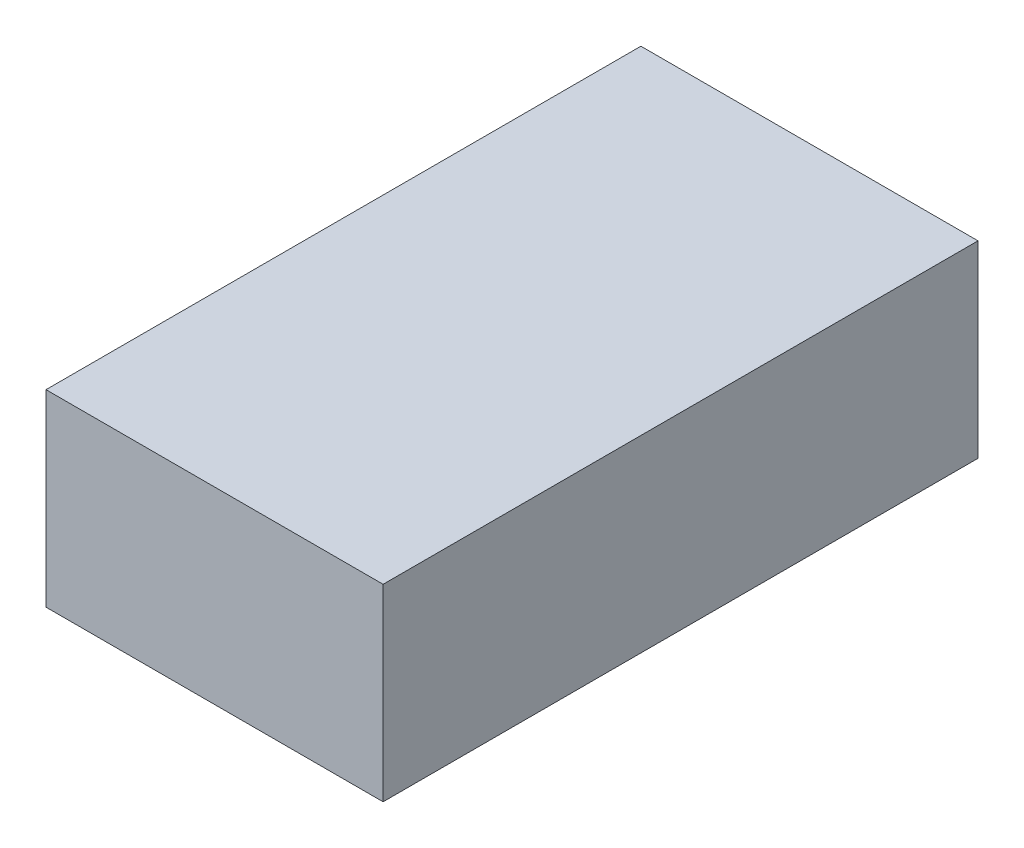
ISO-10303-21;
HEADER;
FILE_DESCRIPTION(('STEP AP214'),'2;1');
FILE_NAME('part.step','',(''),(''),'','','');
FILE_SCHEMA(('AUTOMOTIVE_DESIGN { 1 0 10303 214 1 1 1 1 }'));
ENDSEC;
DATA;
#1=APPLICATION_CONTEXT('core data for automotive mechanical design processes');
#2=APPLICATION_PROTOCOL_DEFINITION('international standard','automotive_design',2000,#1);
#3=PRODUCT_CONTEXT('',#1,'mechanical');
#4=PRODUCT('Part','Part','',(#3));
#5=PRODUCT_RELATED_PRODUCT_CATEGORY('part','',(#4));
#6=PRODUCT_DEFINITION_FORMATION('','',#4);
#7=PRODUCT_DEFINITION_CONTEXT('part definition',#1,'design');
#8=PRODUCT_DEFINITION('design','',#6,#7);
#9=PRODUCT_DEFINITION_SHAPE('','',#8);
#10=(LENGTH_UNIT() NAMED_UNIT(*) SI_UNIT(.MILLI.,.METRE.));
#11=(NAMED_UNIT(*) PLANE_ANGLE_UNIT() SI_UNIT($,.RADIAN.));
#12=(NAMED_UNIT(*) SI_UNIT($,.STERADIAN.) SOLID_ANGLE_UNIT());
#13=UNCERTAINTY_MEASURE_WITH_UNIT(LENGTH_MEASURE(1.E-05),#10,'distance_accuracy_value','');
#14=(GEOMETRIC_REPRESENTATION_CONTEXT(3) GLOBAL_UNCERTAINTY_ASSIGNED_CONTEXT((#13)) GLOBAL_UNIT_ASSIGNED_CONTEXT((#10,
#11,#12)) REPRESENTATION_CONTEXT('',''));
#15=CARTESIAN_POINT('',(0.,0.,0.));
#16=DIRECTION('',(0.,0.,1.));
#17=DIRECTION('',(1.,0.,0.));
#18=AXIS2_PLACEMENT_3D('',#15,#16,#17);
#19=CARTESIAN_POINT('',(-28.0000919228673,28.9523229740386,134.419206641425));
#20=DIRECTION('',(0.999999999998967,1.43736447305881E-06,0.));
#21=DIRECTION('',(-1.43736447305881E-06,0.999999999998967,0.));
#22=AXIS2_PLACEMENT_3D('',#19,#20,#21);
#23=PLANE('',#22);
#24=DIRECTION('',(1.43736447305881E-06,-0.999999999998967,0.));
#25=VECTOR('',#24,1.);
#26=CARTESIAN_POINT('',(-28.0000919228673,28.9523229740386,14.4192066414254));
#27=LINE('',#26,#25);
#28=CARTESIAN_POINT('',(-28.0000919228673,28.9523229740386,14.4192066414254));
#29=VERTEX_POINT('',#28);
#30=CARTESIAN_POINT('',(-28.0000373030174,-9.04767702592175,14.4192066414254));
#31=VERTEX_POINT('',#30);
#32=EDGE_CURVE('E76',#29,#31,#27,.T.);
#33=ORIENTED_EDGE('',*,*,#32,.T.);
#34=DIRECTION('',(0.,0.,-1.));
#35=VECTOR('',#34,1.);
#36=CARTESIAN_POINT('',(-28.0000373030174,-9.04767702592175,134.419206641425));
#37=LINE('',#36,#35);
#38=CARTESIAN_POINT('',(-28.0000373030174,-9.04767702592175,134.419206641425));
#39=VERTEX_POINT('',#38);
#40=EDGE_CURVE('E11',#39,#31,#37,.T.);
#41=ORIENTED_EDGE('',*,*,#40,.F.);
#42=DIRECTION('',(1.43736447305881E-06,-0.999999999998967,0.));
#43=VECTOR('',#42,1.);
#44=CARTESIAN_POINT('',(-28.0000919228673,28.9523229740386,134.419206641425));
#45=LINE('',#44,#43);
#46=CARTESIAN_POINT('',(-28.0000919228673,28.9523229740386,134.419206641425));
#47=VERTEX_POINT('',#46);
#48=EDGE_CURVE('E67',#47,#39,#45,.T.);
#49=ORIENTED_EDGE('',*,*,#48,.F.);
#50=DIRECTION('',(0.,0.,-1.));
#51=VECTOR('',#50,1.);
#52=CARTESIAN_POINT('',(-28.0000919228673,28.9523229740386,134.419206641425));
#53=LINE('',#52,#51);
#54=EDGE_CURVE('E20',#47,#29,#53,.T.);
#55=ORIENTED_EDGE('',*,*,#54,.T.);
#56=EDGE_LOOP('',(#33,#41,#49,#55));
#57=FACE_BOUND('',#56,.T.);
#58=ADVANCED_FACE('F17',(#57),#23,.F.);
#59=CARTESIAN_POINT('',(-28.0000373030174,-9.04767702592215,134.419206641425));
#60=DIRECTION('',(-1.43736447409936E-06,0.999999999998967,0.));
#61=DIRECTION('',(-0.999999999998967,-1.43736447409936E-06,0.));
#62=AXIS2_PLACEMENT_3D('',#59,#60,#61);
#63=PLANE('',#62);
#64=DIRECTION('',(0.999999999998967,1.43736447409936E-06,0.));
#65=VECTOR('',#64,1.);
#66=CARTESIAN_POINT('',(-28.0000373030174,-9.04767702592215,14.4192066414254));
#67=LINE('',#66,#65);
#68=CARTESIAN_POINT('',(39.9999626969124,-9.04757928513791,14.4192066414254));
#69=VERTEX_POINT('',#68);
#70=EDGE_CURVE('E49',#31,#69,#67,.T.);
#71=ORIENTED_EDGE('',*,*,#70,.T.);
#72=DIRECTION('',(0.,0.,-1.));
#73=VECTOR('',#72,1.);
#74=CARTESIAN_POINT('',(39.9999626969124,-9.04757928513791,134.419206641425));
#75=LINE('',#74,#73);
#76=CARTESIAN_POINT('',(39.9999626969124,-9.04757928513791,134.419206641425));
#77=VERTEX_POINT('',#76);
#78=EDGE_CURVE('E26',#77,#69,#75,.T.);
#79=ORIENTED_EDGE('',*,*,#78,.F.);
#80=DIRECTION('',(0.999999999998967,1.43736447409936E-06,0.));
#81=VECTOR('',#80,1.);
#82=CARTESIAN_POINT('',(-28.0000373030174,-9.04767702592215,134.419206641425));
#83=LINE('',#82,#81);
#84=EDGE_CURVE('E63',#39,#77,#83,.T.);
#85=ORIENTED_EDGE('',*,*,#84,.F.);
#86=ORIENTED_EDGE('',*,*,#40,.T.);
#87=EDGE_LOOP('',(#71,#79,#85,#86));
#88=FACE_BOUND('',#87,.T.);
#89=ADVANCED_FACE('F64',(#88),#63,.F.);
#90=CARTESIAN_POINT('',(39.9999626969124,-9.04757928513757,134.419206641425));
#91=DIRECTION('',(-0.999999999998967,-1.43736447378921E-06,0.));
#92=DIRECTION('',(1.43736447378921E-06,-0.999999999998967,0.));
#93=AXIS2_PLACEMENT_3D('',#90,#91,#92);
#94=PLANE('',#93);
#95=DIRECTION('',(-1.43736447378921E-06,0.999999999998967,0.));
#96=VECTOR('',#95,1.);
#97=CARTESIAN_POINT('',(39.9999626969124,-9.04757928513757,14.4192066414254));
#98=LINE('',#97,#96);
#99=CARTESIAN_POINT('',(39.9999080770624,28.9524207148228,14.4192066414254));
#100=VERTEX_POINT('',#99);
#101=EDGE_CURVE('E55',#69,#100,#98,.T.);
#102=ORIENTED_EDGE('',*,*,#101,.T.);
#103=DIRECTION('',(0.,0.,-1.));
#104=VECTOR('',#103,1.);
#105=CARTESIAN_POINT('',(39.9999080770624,28.9524207148228,134.419206641425));
#106=LINE('',#105,#104);
#107=CARTESIAN_POINT('',(39.9999080770624,28.9524207148228,134.419206641425));
#108=VERTEX_POINT('',#107);
#109=EDGE_CURVE('E86',#108,#100,#106,.T.);
#110=ORIENTED_EDGE('',*,*,#109,.F.);
#111=DIRECTION('',(-1.43736447378921E-06,0.999999999998967,0.));
#112=VECTOR('',#111,1.);
#113=CARTESIAN_POINT('',(39.9999626969124,-9.04757928513757,134.419206641425));
#114=LINE('',#113,#112);
#115=EDGE_CURVE('E34',#77,#108,#114,.T.);
#116=ORIENTED_EDGE('',*,*,#115,.F.);
#117=ORIENTED_EDGE('',*,*,#78,.T.);
#118=EDGE_LOOP('',(#102,#110,#116,#117));
#119=FACE_BOUND('',#118,.T.);
#120=ADVANCED_FACE('F88',(#119),#94,.F.);
#121=CARTESIAN_POINT('',(39.9999080770624,28.9524207148228,134.419206641425));
#122=DIRECTION('',(1.43736447407384E-06,-0.999999999998967,0.));
#123=DIRECTION('',(0.999999999998967,1.43736447407384E-06,0.));
#124=AXIS2_PLACEMENT_3D('',#121,#122,#123);
#125=PLANE('',#124);
#126=DIRECTION('',(-0.999999999998967,-1.43736447407384E-06,0.));
#127=VECTOR('',#126,1.);
#128=CARTESIAN_POINT('',(39.9999080770624,28.9524207148228,14.4192066414254));
#129=LINE('',#128,#127);
#130=EDGE_CURVE('E73',#100,#29,#129,.T.);
#131=ORIENTED_EDGE('',*,*,#130,.T.);
#132=ORIENTED_EDGE('',*,*,#54,.F.);
#133=DIRECTION('',(-0.999999999998967,-1.43736447407384E-06,0.));
#134=VECTOR('',#133,1.);
#135=CARTESIAN_POINT('',(39.9999080770624,28.9524207148228,134.419206641425));
#136=LINE('',#135,#134);
#137=EDGE_CURVE('E60',#108,#47,#136,.T.);
#138=ORIENTED_EDGE('',*,*,#137,.F.);
#139=ORIENTED_EDGE('',*,*,#109,.T.);
#140=EDGE_LOOP('',(#131,#132,#138,#139));
#141=FACE_BOUND('',#140,.T.);
#142=ADVANCED_FACE('F91',(#141),#125,.F.);
#143=CARTESIAN_POINT('',(0.,0.,134.419206641425));
#144=DIRECTION('',(0.,0.,1.));
#145=DIRECTION('',(1.,0.,0.));
#146=AXIS2_PLACEMENT_3D('',#143,#144,#145);
#147=PLANE('',#146);
#148=ORIENTED_EDGE('',*,*,#48,.T.);
#149=ORIENTED_EDGE('',*,*,#84,.T.);
#150=ORIENTED_EDGE('',*,*,#115,.T.);
#151=ORIENTED_EDGE('',*,*,#137,.T.);
#152=EDGE_LOOP('',(#148,#149,#150,#151));
#153=FACE_BOUND('',#152,.T.);
#154=ADVANCED_FACE('F70',(#153),#147,.T.);
#155=CARTESIAN_POINT('',(0.,0.,14.4192066414254));
#156=DIRECTION('',(0.,0.,1.));
#157=DIRECTION('',(1.,0.,0.));
#158=AXIS2_PLACEMENT_3D('',#155,#156,#157);
#159=PLANE('',#158);
#160=ORIENTED_EDGE('',*,*,#32,.F.);
#161=ORIENTED_EDGE('',*,*,#130,.F.);
#162=ORIENTED_EDGE('',*,*,#101,.F.);
#163=ORIENTED_EDGE('',*,*,#70,.F.);
#164=EDGE_LOOP('',(#160,#161,#162,#163));
#165=FACE_BOUND('',#164,.T.);
#166=ADVANCED_FACE('F89',(#165),#159,.F.);
#167=CLOSED_SHELL('',(#58,#89,#120,#142,#154,#166));
#168=MANIFOLD_SOLID_BREP('B1',#167);
#169=ADVANCED_BREP_SHAPE_REPRESENTATION('',(#18,#168),#14);
#170=SHAPE_DEFINITION_REPRESENTATION(#9,#169);
ENDSEC;
END-ISO-10303-21;
